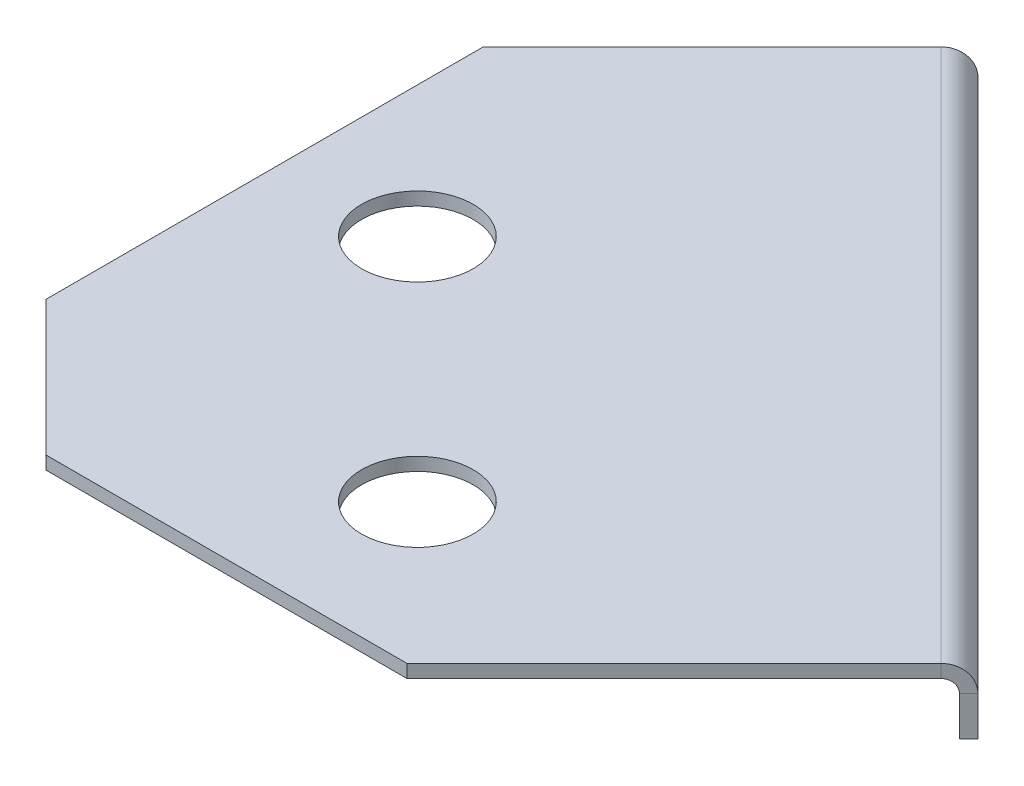
ISO-10303-21;
HEADER;
FILE_DESCRIPTION(('STEP AP214'),'2;1');
FILE_NAME('part.step','',(''),(''),'','','');
FILE_SCHEMA(('AUTOMOTIVE_DESIGN { 1 0 10303 214 1 1 1 1 }'));
ENDSEC;
DATA;
#1=APPLICATION_CONTEXT('core data for automotive mechanical design processes');
#2=APPLICATION_PROTOCOL_DEFINITION('international standard','automotive_design',2000,#1);
#3=PRODUCT_CONTEXT('',#1,'mechanical');
#4=PRODUCT('Part','Part','',(#3));
#5=PRODUCT_RELATED_PRODUCT_CATEGORY('part','',(#4));
#6=PRODUCT_DEFINITION_FORMATION('','',#4);
#7=PRODUCT_DEFINITION_CONTEXT('part definition',#1,'design');
#8=PRODUCT_DEFINITION('design','',#6,#7);
#9=PRODUCT_DEFINITION_SHAPE('','',#8);
#10=(LENGTH_UNIT() NAMED_UNIT(*) SI_UNIT(.MILLI.,.METRE.));
#11=(NAMED_UNIT(*) PLANE_ANGLE_UNIT() SI_UNIT($,.RADIAN.));
#12=(NAMED_UNIT(*) SI_UNIT($,.STERADIAN.) SOLID_ANGLE_UNIT());
#13=UNCERTAINTY_MEASURE_WITH_UNIT(LENGTH_MEASURE(1.E-05),#10,'distance_accuracy_value','');
#14=(GEOMETRIC_REPRESENTATION_CONTEXT(3) GLOBAL_UNCERTAINTY_ASSIGNED_CONTEXT((#13)) GLOBAL_UNIT_ASSIGNED_CONTEXT((#10,
#11,#12)) REPRESENTATION_CONTEXT('',''));
#15=CARTESIAN_POINT('',(0.,0.,0.));
#16=DIRECTION('',(0.,0.,1.));
#17=DIRECTION('',(1.,0.,0.));
#18=AXIS2_PLACEMENT_3D('',#15,#16,#17);
#19=CARTESIAN_POINT('',(-0.949979927557368,-0.2,7.02125460176061));
#20=DIRECTION('',(0.707106781186539,0.,0.707106781186556));
#21=DIRECTION('',(0.707106781186556,0.,-0.707106781186539));
#22=AXIS2_PLACEMENT_3D('',#19,#20,#21);
#23=PLANE('',#22);
#24=DIRECTION('',(0.707106781186556,0.,-0.707106781186539));
#25=VECTOR('',#24,1.);
#26=CARTESIAN_POINT('',(-0.949979927557368,-0.2,7.02125460176061));
#27=LINE('',#26,#25);
#28=CARTESIAN_POINT('',(-0.949979927557368,-0.2,7.02125460176061));
#29=VERTEX_POINT('',#28);
#30=CARTESIAN_POINT('',(3.11665363852389,-0.199999999999798,2.95462103567946));
#31=VERTEX_POINT('',#30);
#32=EDGE_CURVE('E198',#29,#31,#27,.T.);
#33=ORIENTED_EDGE('',*,*,#32,.T.);
#34=DIRECTION('',(-2.44595859093155E-13,1.,2.28116288110365E-13));
#35=VECTOR('',#34,1.);
#36=CARTESIAN_POINT('',(3.11665363852389,-0.199999999999798,2.95462103567946));
#37=LINE('',#36,#35);
#38=CARTESIAN_POINT('',(3.11665363852384,2.01661604082304E-13,2.9546210356795));
#39=VERTEX_POINT('',#38);
#40=EDGE_CURVE('E177',#31,#39,#37,.T.);
#41=ORIENTED_EDGE('',*,*,#40,.T.);
#42=DIRECTION('',(0.707106781186556,0.,-0.707106781186539));
#43=VECTOR('',#42,1.);
#44=CARTESIAN_POINT('',(-0.949979927557368,0.,7.02125460176061));
#45=LINE('',#44,#43);
#46=CARTESIAN_POINT('',(-0.949979927557368,0.,7.02125460176061));
#47=VERTEX_POINT('',#46);
#48=EDGE_CURVE('E190',#47,#39,#45,.T.);
#49=ORIENTED_EDGE('',*,*,#48,.F.);
#50=DIRECTION('',(0.,1.,0.));
#51=VECTOR('',#50,1.);
#52=CARTESIAN_POINT('',(-0.949979927557368,-0.2,7.02125460176061));
#53=LINE('',#52,#51);
#54=EDGE_CURVE('E11',#29,#47,#53,.T.);
#55=ORIENTED_EDGE('',*,*,#54,.F.);
#56=EDGE_LOOP('',(#33,#41,#49,#55));
#57=FACE_BOUND('',#56,.T.);
#58=ADVANCED_FACE('F40',(#57),#23,.T.);
#59=CARTESIAN_POINT('',(0.,-0.2,0.));
#60=DIRECTION('',(0.,1.,0.));
#61=DIRECTION('',(0.,0.,1.));
#62=AXIS2_PLACEMENT_3D('',#59,#60,#61);
#63=PLANE('',#62);
#64=CARTESIAN_POINT('',(-6.5,-0.2,1.31105583771245));
#65=DIRECTION('',(0.,1.,0.));
#66=DIRECTION('',(0.,0.,1.));
#67=AXIS2_PLACEMENT_3D('',#64,#65,#66);
#68=CIRCLE('',#67,0.849999999999994);
#69=CARTESIAN_POINT('',(-6.5,-0.2,2.16105583771244));
#70=VERTEX_POINT('',#69);
#71=EDGE_CURVE('E288',#70,#70,#68,.T.);
#72=ORIENTED_EDGE('',*,*,#71,.T.);
#73=EDGE_LOOP('',(#72));
#74=FACE_BOUND('',#73,.T.);
#75=CARTESIAN_POINT('',(-3.,-0.2,4.81105583771245));
#76=DIRECTION('',(0.,1.,0.));
#77=DIRECTION('',(0.,0.,1.));
#78=AXIS2_PLACEMENT_3D('',#75,#76,#77);
#79=CIRCLE('',#78,0.849999999999994);
#80=CARTESIAN_POINT('',(-3.,-0.2,5.66105583771244));
#81=VERTEX_POINT('',#80);
#82=EDGE_CURVE('E298',#81,#81,#79,.T.);
#83=ORIENTED_EDGE('',*,*,#82,.T.);
#84=EDGE_LOOP('',(#83));
#85=FACE_BOUND('',#84,.T.);
#86=DIRECTION('',(0.707106781186547,0.,0.707106781186547));
#87=VECTOR('',#86,1.);
#88=CARTESIAN_POINT('',(3.11665363852389,-0.199999999999798,2.95462103567946));
#89=LINE('',#88,#87);
#90=CARTESIAN_POINT('',(-5.01507434512098,-0.199999999999932,-5.17710694796541));
#91=VERTEX_POINT('',#90);
#92=EDGE_CURVE('E181',#31,#91,#89,.F.);
#93=ORIENTED_EDGE('',*,*,#92,.F.);
#94=ORIENTED_EDGE('',*,*,#32,.F.);
#95=DIRECTION('',(1.,0.,0.));
#96=VECTOR('',#95,1.);
#97=CARTESIAN_POINT('',(-6.44665548544419,-0.2,7.02125460176061));
#98=LINE('',#97,#96);
#99=CARTESIAN_POINT('',(-6.44665548544419,-0.2,7.02125460176061));
#100=VERTEX_POINT('',#99);
#101=EDGE_CURVE('E196',#100,#29,#98,.T.);
#102=ORIENTED_EDGE('',*,*,#101,.F.);
#103=DIRECTION('',(0.707106781186553,0.,0.707106781186542));
#104=VECTOR('',#103,1.);
#105=CARTESIAN_POINT('',(-8.50000000000009,-0.2,4.96791008720475));
#106=LINE('',#105,#104);
#107=CARTESIAN_POINT('',(-8.50000000000009,-0.2,4.96791008720475));
#108=VERTEX_POINT('',#107);
#109=EDGE_CURVE('E193',#108,#100,#106,.T.);
#110=ORIENTED_EDGE('',*,*,#109,.F.);
#111=DIRECTION('',(0.,0.,1.));
#112=VECTOR('',#111,1.);
#113=CARTESIAN_POINT('',(-8.5,-0.2,-1.69218129308647));
#114=LINE('',#113,#112);
#115=CARTESIAN_POINT('',(-8.5,-0.2,-1.69218129308647));
#116=VERTEX_POINT('',#115);
#117=EDGE_CURVE('E189',#116,#108,#114,.T.);
#118=ORIENTED_EDGE('',*,*,#117,.F.);
#119=DIRECTION('',(-0.707106781186556,0.,0.707106781186539));
#120=VECTOR('',#119,1.);
#121=CARTESIAN_POINT('',(-4.87365298888357,-0.2,-5.31852830420281));
#122=LINE('',#121,#120);
#123=EDGE_CURVE('E91',#91,#116,#122,.T.);
#124=ORIENTED_EDGE('',*,*,#123,.F.);
#125=EDGE_LOOP('',(#93,#94,#102,#110,#118,#124));
#126=FACE_BOUND('',#125,.T.);
#127=ADVANCED_FACE('F227',(#74,#85,#126),#63,.F.);
#128=CARTESIAN_POINT('',(0.,0.,0.));
#129=DIRECTION('',(0.,1.,0.));
#130=DIRECTION('',(0.,0.,1.));
#131=AXIS2_PLACEMENT_3D('',#128,#129,#130);
#132=PLANE('',#131);
#133=CARTESIAN_POINT('',(-6.5,0.,1.31105583771245));
#134=DIRECTION('',(0.,1.,0.));
#135=DIRECTION('',(0.,0.,1.));
#136=AXIS2_PLACEMENT_3D('',#133,#134,#135);
#137=CIRCLE('',#136,0.849999999999988);
#138=CARTESIAN_POINT('',(-6.5,0.,2.16105583771244));
#139=VERTEX_POINT('',#138);
#140=EDGE_CURVE('E291',#139,#139,#137,.T.);
#141=ORIENTED_EDGE('',*,*,#140,.F.);
#142=EDGE_LOOP('',(#141));
#143=FACE_BOUND('',#142,.T.);
#144=CARTESIAN_POINT('',(-3.,0.,4.81105583771245));
#145=DIRECTION('',(0.,1.,0.));
#146=DIRECTION('',(0.,0.,1.));
#147=AXIS2_PLACEMENT_3D('',#144,#145,#146);
#148=CIRCLE('',#147,0.849999999999988);
#149=CARTESIAN_POINT('',(-3.,0.,5.66105583771244));
#150=VERTEX_POINT('',#149);
#151=EDGE_CURVE('E293',#150,#150,#148,.T.);
#152=ORIENTED_EDGE('',*,*,#151,.F.);
#153=EDGE_LOOP('',(#152));
#154=FACE_BOUND('',#153,.T.);
#155=ORIENTED_EDGE('',*,*,#48,.T.);
#156=DIRECTION('',(0.707106781186547,0.,0.707106781186547));
#157=VECTOR('',#156,1.);
#158=CARTESIAN_POINT('',(3.11665363852384,2.01661604082304E-13,2.9546210356795));
#159=LINE('',#158,#157);
#160=CARTESIAN_POINT('',(-5.01507434512098,0.,-5.17710694796541));
#161=VERTEX_POINT('',#160);
#162=EDGE_CURVE('E131',#39,#161,#159,.F.);
#163=ORIENTED_EDGE('',*,*,#162,.T.);
#164=DIRECTION('',(-0.707106781186556,0.,0.707106781186539));
#165=VECTOR('',#164,1.);
#166=CARTESIAN_POINT('',(-4.87365298888357,0.,-5.31852830420281));
#167=LINE('',#166,#165);
#168=CARTESIAN_POINT('',(-8.5,0.,-1.69218129308647));
#169=VERTEX_POINT('',#168);
#170=EDGE_CURVE('E186',#161,#169,#167,.T.);
#171=ORIENTED_EDGE('',*,*,#170,.T.);
#172=DIRECTION('',(0.,0.,1.));
#173=VECTOR('',#172,1.);
#174=CARTESIAN_POINT('',(-8.5,0.,-1.69218129308647));
#175=LINE('',#174,#173);
#176=CARTESIAN_POINT('',(-8.50000000000009,0.,4.96791008720475));
#177=VERTEX_POINT('',#176);
#178=EDGE_CURVE('E201',#169,#177,#175,.T.);
#179=ORIENTED_EDGE('',*,*,#178,.T.);
#180=DIRECTION('',(0.707106781186553,0.,0.707106781186542));
#181=VECTOR('',#180,1.);
#182=CARTESIAN_POINT('',(-8.50000000000009,0.,4.96791008720475));
#183=LINE('',#182,#181);
#184=CARTESIAN_POINT('',(-6.44665548544419,0.,7.02125460176061));
#185=VERTEX_POINT('',#184);
#186=EDGE_CURVE('E204',#177,#185,#183,.T.);
#187=ORIENTED_EDGE('',*,*,#186,.T.);
#188=DIRECTION('',(1.,0.,0.));
#189=VECTOR('',#188,1.);
#190=CARTESIAN_POINT('',(-6.44665548544419,0.,7.02125460176061));
#191=LINE('',#190,#189);
#192=EDGE_CURVE('E207',#185,#47,#191,.T.);
#193=ORIENTED_EDGE('',*,*,#192,.T.);
#194=EDGE_LOOP('',(#155,#163,#171,#179,#187,#193));
#195=FACE_BOUND('',#194,.T.);
#196=ADVANCED_FACE('F219',(#143,#154,#195),#132,.T.);
#197=CARTESIAN_POINT('',(-6.44665548544419,-0.2,7.02125460176061));
#198=DIRECTION('',(0.,0.,1.));
#199=DIRECTION('',(1.,0.,0.));
#200=AXIS2_PLACEMENT_3D('',#197,#198,#199);
#201=PLANE('',#200);
#202=ORIENTED_EDGE('',*,*,#192,.F.);
#203=DIRECTION('',(0.,1.,0.));
#204=VECTOR('',#203,1.);
#205=CARTESIAN_POINT('',(-6.44665548544419,-0.2,7.02125460176061));
#206=LINE('',#205,#204);
#207=EDGE_CURVE('E49',#100,#185,#206,.T.);
#208=ORIENTED_EDGE('',*,*,#207,.F.);
#209=ORIENTED_EDGE('',*,*,#101,.T.);
#210=ORIENTED_EDGE('',*,*,#54,.T.);
#211=EDGE_LOOP('',(#202,#208,#209,#210));
#212=FACE_BOUND('',#211,.T.);
#213=ADVANCED_FACE('F232',(#212),#201,.T.);
#214=CARTESIAN_POINT('',(-8.50000000000009,-0.2,4.96791008720475));
#215=DIRECTION('',(-0.707106781186542,0.,0.707106781186553));
#216=DIRECTION('',(0.707106781186553,0.,0.707106781186542));
#217=AXIS2_PLACEMENT_3D('',#214,#215,#216);
#218=PLANE('',#217);
#219=ORIENTED_EDGE('',*,*,#186,.F.);
#220=DIRECTION('',(0.,1.,0.));
#221=VECTOR('',#220,1.);
#222=CARTESIAN_POINT('',(-8.50000000000009,-0.2,4.96791008720475));
#223=LINE('',#222,#221);
#224=EDGE_CURVE('E211',#108,#177,#223,.T.);
#225=ORIENTED_EDGE('',*,*,#224,.F.);
#226=ORIENTED_EDGE('',*,*,#109,.T.);
#227=ORIENTED_EDGE('',*,*,#207,.T.);
#228=EDGE_LOOP('',(#219,#225,#226,#227));
#229=FACE_BOUND('',#228,.T.);
#230=ADVANCED_FACE('F231',(#229),#218,.T.);
#231=CARTESIAN_POINT('',(-8.5,-0.2,-1.69218129308647));
#232=DIRECTION('',(-1.,0.,0.));
#233=DIRECTION('',(0.,0.,1.));
#234=AXIS2_PLACEMENT_3D('',#231,#232,#233);
#235=PLANE('',#234);
#236=ORIENTED_EDGE('',*,*,#178,.F.);
#237=DIRECTION('',(0.,1.,0.));
#238=VECTOR('',#237,1.);
#239=CARTESIAN_POINT('',(-8.5,-0.2,-1.69218129308647));
#240=LINE('',#239,#238);
#241=EDGE_CURVE('E44',#116,#169,#240,.T.);
#242=ORIENTED_EDGE('',*,*,#241,.F.);
#243=ORIENTED_EDGE('',*,*,#117,.T.);
#244=ORIENTED_EDGE('',*,*,#224,.T.);
#245=EDGE_LOOP('',(#236,#242,#243,#244));
#246=FACE_BOUND('',#245,.T.);
#247=ADVANCED_FACE('F217',(#246),#235,.T.);
#248=CARTESIAN_POINT('',(-4.87365298888357,-0.2,-5.31852830420281));
#249=DIRECTION('',(-0.707106781186539,0.,-0.707106781186556));
#250=DIRECTION('',(-0.707106781186556,0.,0.707106781186539));
#251=AXIS2_PLACEMENT_3D('',#248,#249,#250);
#252=PLANE('',#251);
#253=DIRECTION('',(-2.51534904016552E-13,1.,2.16840434497027E-13));
#254=VECTOR('',#253,1.);
#255=CARTESIAN_POINT('',(-5.01507434512098,-0.199999999999932,-5.17710694796541));
#256=LINE('',#255,#254);
#257=EDGE_CURVE('E184',#91,#161,#256,.T.);
#258=ORIENTED_EDGE('',*,*,#257,.F.);
#259=ORIENTED_EDGE('',*,*,#123,.T.);
#260=ORIENTED_EDGE('',*,*,#241,.T.);
#261=ORIENTED_EDGE('',*,*,#170,.F.);
#262=EDGE_LOOP('',(#258,#259,#260,#261));
#263=FACE_BOUND('',#262,.T.);
#264=ADVANCED_FACE('F42',(#263),#252,.T.);
#265=CARTESIAN_POINT('',(-5.01507434512093,-0.4,-5.17710694796545));
#266=DIRECTION('',(-0.707106781186547,0.,-0.707106781186547));
#267=DIRECTION('',(-0.707106781186548,0.,0.707106781186548));
#268=AXIS2_PLACEMENT_3D('',#265,#266,#267);
#269=PLANE('',#268);
#270=DIRECTION('',(0.707106781186556,0.,-0.707106781186539));
#271=VECTOR('',#270,1.);
#272=CARTESIAN_POINT('',(-4.87365298888357,-0.399999999999999,-5.31852830420281));
#273=LINE('',#272,#271);
#274=CARTESIAN_POINT('',(-4.87365298888357,-0.399999999999999,-5.31852830420281));
#275=VERTEX_POINT('',#274);
#276=CARTESIAN_POINT('',(-4.73223163264626,-0.399999999999998,-5.45994966044012));
#277=VERTEX_POINT('',#276);
#278=EDGE_CURVE('E301',#275,#277,#273,.T.);
#279=ORIENTED_EDGE('',*,*,#278,.F.);
#280=CARTESIAN_POINT('',(-5.01507434512093,-0.4,-5.17710694796545));
#281=DIRECTION('',(0.707106781186547,0.,0.707106781186547));
#282=DIRECTION('',(0.707106781186548,0.,-0.707106781186548));
#283=AXIS2_PLACEMENT_3D('',#280,#281,#282);
#284=CIRCLE('',#283,0.200000000000068);
#285=EDGE_CURVE('E134',#91,#275,#284,.F.);
#286=ORIENTED_EDGE('',*,*,#285,.F.);
#287=ORIENTED_EDGE('',*,*,#257,.T.);
#288=CARTESIAN_POINT('',(-5.01507434512093,-0.4,-5.17710694796545));
#289=DIRECTION('',(0.707106781186547,0.,0.707106781186547));
#290=DIRECTION('',(0.707106781186548,0.,-0.707106781186548));
#291=AXIS2_PLACEMENT_3D('',#288,#289,#290);
#292=CIRCLE('',#291,0.400000000000068);
#293=EDGE_CURVE('E57',#161,#277,#292,.F.);
#294=ORIENTED_EDGE('',*,*,#293,.T.);
#295=EDGE_LOOP('',(#279,#286,#287,#294));
#296=FACE_BOUND('',#295,.T.);
#297=ADVANCED_FACE('F252',(#296),#269,.T.);
#298=CARTESIAN_POINT('',(3.11665363852393,-0.399999999999866,2.95462103567941));
#299=DIRECTION('',(-0.707106781186547,0.,-0.707106781186547));
#300=DIRECTION('',(-0.707106781186548,0.,0.707106781186548));
#301=AXIS2_PLACEMENT_3D('',#298,#299,#300);
#302=PLANE('',#301);
#303=CARTESIAN_POINT('',(3.11665363852393,-0.399999999999866,2.95462103567941));
#304=DIRECTION('',(0.707106781186547,0.,0.707106781186547));
#305=DIRECTION('',(0.707106781186548,0.,-0.707106781186548));
#306=AXIS2_PLACEMENT_3D('',#303,#304,#305);
#307=CIRCLE('',#306,0.200000000000068);
#308=CARTESIAN_POINT('',(3.25807499476129,-0.399999999999865,2.81319967944205));
#309=VERTEX_POINT('',#308);
#310=EDGE_CURVE('E141',#309,#31,#307,.T.);
#311=ORIENTED_EDGE('',*,*,#310,.F.);
#312=DIRECTION('',(0.707106781186556,0.,-0.707106781186539));
#313=VECTOR('',#312,1.);
#314=CARTESIAN_POINT('',(3.2580749947612,-0.399999999999865,2.81319967944215));
#315=LINE('',#314,#313);
#316=CARTESIAN_POINT('',(3.39949635099851,-0.399999999999864,2.67177832320484));
#317=VERTEX_POINT('',#316);
#318=EDGE_CURVE('E138',#309,#317,#315,.T.);
#319=ORIENTED_EDGE('',*,*,#318,.T.);
#320=CARTESIAN_POINT('',(3.11665363852393,-0.399999999999866,2.95462103567941));
#321=DIRECTION('',(0.707106781186547,0.,0.707106781186547));
#322=DIRECTION('',(0.707106781186548,0.,-0.707106781186548));
#323=AXIS2_PLACEMENT_3D('',#320,#321,#322);
#324=CIRCLE('',#323,0.400000000000068);
#325=EDGE_CURVE('E125',#317,#39,#324,.T.);
#326=ORIENTED_EDGE('',*,*,#325,.T.);
#327=ORIENTED_EDGE('',*,*,#40,.F.);
#328=EDGE_LOOP('',(#311,#319,#326,#327));
#329=FACE_BOUND('',#328,.T.);
#330=ADVANCED_FACE('F139',(#329),#302,.F.);
#331=CARTESIAN_POINT('',(3.11665363852393,-0.399999999999866,2.95462103567941));
#332=DIRECTION('',(0.707106781186547,0.,0.707106781186547));
#333=DIRECTION('',(0.707106781186548,0.,-0.707106781186548));
#334=AXIS2_PLACEMENT_3D('',#331,#332,#333);
#335=CYLINDRICAL_SURFACE('',#334,0.400000000000068);
#336=ORIENTED_EDGE('',*,*,#162,.F.);
#337=ORIENTED_EDGE('',*,*,#325,.F.);
#338=DIRECTION('',(-0.707106781186539,0.,-0.707106781186556));
#339=VECTOR('',#338,1.);
#340=CARTESIAN_POINT('',(0.363859013896878,-0.399999999999914,-0.363859013896863));
#341=LINE('',#340,#339);
#342=EDGE_CURVE('E129',#317,#277,#341,.T.);
#343=ORIENTED_EDGE('',*,*,#342,.T.);
#344=ORIENTED_EDGE('',*,*,#293,.F.);
#345=EDGE_LOOP('',(#336,#337,#343,#344));
#346=FACE_BOUND('',#345,.T.);
#347=ADVANCED_FACE('F127',(#346),#335,.T.);
#348=CARTESIAN_POINT('',(3.11665363852393,-0.399999999999866,2.95462103567941));
#349=DIRECTION('',(0.707106781186547,0.,0.707106781186547));
#350=DIRECTION('',(0.707106781186548,0.,-0.707106781186548));
#351=AXIS2_PLACEMENT_3D('',#348,#349,#350);
#352=CYLINDRICAL_SURFACE('',#351,0.200000000000068);
#353=ORIENTED_EDGE('',*,*,#92,.T.);
#354=ORIENTED_EDGE('',*,*,#285,.T.);
#355=DIRECTION('',(0.707106781186539,0.,0.707106781186556));
#356=VECTOR('',#355,1.);
#357=CARTESIAN_POINT('',(-4.87365298888357,-0.399999999999999,-5.31852830420281));
#358=LINE('',#357,#356);
#359=EDGE_CURVE('E145',#275,#309,#358,.T.);
#360=ORIENTED_EDGE('',*,*,#359,.T.);
#361=ORIENTED_EDGE('',*,*,#310,.T.);
#362=EDGE_LOOP('',(#353,#354,#360,#361));
#363=FACE_BOUND('',#362,.T.);
#364=ADVANCED_FACE('F223',(#363),#352,.F.);
#365=CARTESIAN_POINT('',(3.39949635099851,-1.,2.67177832320484));
#366=DIRECTION('',(-0.707106781186539,0.,-0.707106781186556));
#367=DIRECTION('',(-0.707106781186556,0.,0.707106781186539));
#368=AXIS2_PLACEMENT_3D('',#365,#366,#367);
#369=PLANE('',#368);
#370=ORIENTED_EDGE('',*,*,#318,.F.);
#371=DIRECTION('',(0.,-1.,0.));
#372=VECTOR('',#371,1.);
#373=CARTESIAN_POINT('',(3.2580749947612,-1.,2.81319967944214));
#374=LINE('',#373,#372);
#375=CARTESIAN_POINT('',(3.2580749947612,-1.,2.81319967944214));
#376=VERTEX_POINT('',#375);
#377=EDGE_CURVE('E154',#309,#376,#374,.T.);
#378=ORIENTED_EDGE('',*,*,#377,.T.);
#379=DIRECTION('',(-0.707106781186556,0.,0.707106781186539));
#380=VECTOR('',#379,1.);
#381=CARTESIAN_POINT('',(3.39949635099851,-1.,2.67177832320484));
#382=LINE('',#381,#380);
#383=CARTESIAN_POINT('',(3.39949635099851,-1.,2.67177832320484));
#384=VERTEX_POINT('',#383);
#385=EDGE_CURVE('E159',#384,#376,#382,.T.);
#386=ORIENTED_EDGE('',*,*,#385,.F.);
#387=DIRECTION('',(0.,-1.,0.));
#388=VECTOR('',#387,1.);
#389=CARTESIAN_POINT('',(3.39949635099851,-1.,2.67177832320484));
#390=LINE('',#389,#388);
#391=EDGE_CURVE('E150',#317,#384,#390,.T.);
#392=ORIENTED_EDGE('',*,*,#391,.F.);
#393=EDGE_LOOP('',(#370,#378,#386,#392));
#394=FACE_BOUND('',#393,.T.);
#395=ADVANCED_FACE('F157',(#394),#369,.F.);
#396=CARTESIAN_POINT('',(-4.73223163264626,-0.199999999999999,-5.45994966044012));
#397=DIRECTION('',(0.707106781186539,0.,0.707106781186556));
#398=DIRECTION('',(0.707106781186556,0.,-0.707106781186539));
#399=AXIS2_PLACEMENT_3D('',#396,#397,#398);
#400=PLANE('',#399);
#401=ORIENTED_EDGE('',*,*,#278,.T.);
#402=DIRECTION('',(0.,1.,0.));
#403=VECTOR('',#402,1.);
#404=CARTESIAN_POINT('',(-4.73223163264626,-0.199999999999999,-5.45994966044012));
#405=LINE('',#404,#403);
#406=CARTESIAN_POINT('',(-4.73223163264626,-1.,-5.45994966044012));
#407=VERTEX_POINT('',#406);
#408=EDGE_CURVE('E153',#407,#277,#405,.T.);
#409=ORIENTED_EDGE('',*,*,#408,.F.);
#410=DIRECTION('',(-0.707106781186556,0.,0.707106781186539));
#411=VECTOR('',#410,1.);
#412=CARTESIAN_POINT('',(-4.73223163264626,-1.,-5.45994966044012));
#413=LINE('',#412,#411);
#414=CARTESIAN_POINT('',(-4.87365298888357,-1.,-5.31852830420281));
#415=VERTEX_POINT('',#414);
#416=EDGE_CURVE('E170',#407,#415,#413,.T.);
#417=ORIENTED_EDGE('',*,*,#416,.T.);
#418=DIRECTION('',(0.,1.,0.));
#419=VECTOR('',#418,1.);
#420=CARTESIAN_POINT('',(-4.87365298888357,-0.2,-5.31852830420281));
#421=LINE('',#420,#419);
#422=EDGE_CURVE('E161',#415,#275,#421,.T.);
#423=ORIENTED_EDGE('',*,*,#422,.T.);
#424=EDGE_LOOP('',(#401,#409,#417,#423));
#425=FACE_BOUND('',#424,.T.);
#426=ADVANCED_FACE('F262',(#425),#400,.F.);
#427=CARTESIAN_POINT('',(0.363859013896873,0.,-0.363859013896865));
#428=DIRECTION('',(-0.707106781186556,0.,0.707106781186539));
#429=DIRECTION('',(0.707106781186539,0.,0.707106781186556));
#430=AXIS2_PLACEMENT_3D('',#427,#428,#429);
#431=PLANE('',#430);
#432=ORIENTED_EDGE('',*,*,#342,.F.);
#433=ORIENTED_EDGE('',*,*,#391,.T.);
#434=DIRECTION('',(-0.707106781186539,0.,-0.707106781186556));
#435=VECTOR('',#434,1.);
#436=CARTESIAN_POINT('',(-4.73223163264626,-1.,-5.45994966044012));
#437=LINE('',#436,#435);
#438=EDGE_CURVE('E160',#384,#407,#437,.T.);
#439=ORIENTED_EDGE('',*,*,#438,.T.);
#440=ORIENTED_EDGE('',*,*,#408,.T.);
#441=EDGE_LOOP('',(#432,#433,#439,#440));
#442=FACE_BOUND('',#441,.T.);
#443=ADVANCED_FACE('F149',(#442),#431,.F.);
#444=CARTESIAN_POINT('',(0.222437657659562,0.,-0.222437657659557));
#445=DIRECTION('',(-0.707106781186556,0.,0.707106781186539));
#446=DIRECTION('',(0.707106781186539,0.,0.707106781186556));
#447=AXIS2_PLACEMENT_3D('',#444,#445,#446);
#448=PLANE('',#447);
#449=ORIENTED_EDGE('',*,*,#377,.F.);
#450=ORIENTED_EDGE('',*,*,#359,.F.);
#451=ORIENTED_EDGE('',*,*,#422,.F.);
#452=DIRECTION('',(-0.707106781186539,0.,-0.707106781186556));
#453=VECTOR('',#452,1.);
#454=CARTESIAN_POINT('',(-4.87365298888357,-1.,-5.31852830420281));
#455=LINE('',#454,#453);
#456=EDGE_CURVE('E165',#376,#415,#455,.T.);
#457=ORIENTED_EDGE('',*,*,#456,.F.);
#458=EDGE_LOOP('',(#449,#450,#451,#457));
#459=FACE_BOUND('',#458,.T.);
#460=ADVANCED_FACE('F267',(#459),#448,.T.);
#461=CARTESIAN_POINT('',(-4.73223163264626,-1.,-5.45994966044012));
#462=DIRECTION('',(0.,1.,0.));
#463=DIRECTION('',(-1.,0.,0.));
#464=AXIS2_PLACEMENT_3D('',#461,#462,#463);
#465=PLANE('',#464);
#466=ORIENTED_EDGE('',*,*,#456,.T.);
#467=ORIENTED_EDGE('',*,*,#416,.F.);
#468=ORIENTED_EDGE('',*,*,#438,.F.);
#469=ORIENTED_EDGE('',*,*,#385,.T.);
#470=EDGE_LOOP('',(#466,#467,#468,#469));
#471=FACE_BOUND('',#470,.T.);
#472=ADVANCED_FACE('F263',(#471),#465,.F.);
#473=CARTESIAN_POINT('',(-3.,0.,4.81105583771245));
#474=DIRECTION('',(0.,1.,0.));
#475=DIRECTION('',(0.,0.,1.));
#476=AXIS2_PLACEMENT_3D('',#473,#474,#475);
#477=CYLINDRICAL_SURFACE('',#476,0.849999999999994);
#478=ORIENTED_EDGE('',*,*,#82,.F.);
#479=EDGE_LOOP('',(#478));
#480=FACE_BOUND('',#479,.T.);
#481=ORIENTED_EDGE('',*,*,#151,.T.);
#482=EDGE_LOOP('',(#481));
#483=FACE_BOUND('',#482,.T.);
#484=ADVANCED_FACE('F266',(#480,#483),#477,.F.);
#485=CARTESIAN_POINT('',(-6.5,0.,1.31105583771245));
#486=DIRECTION('',(0.,1.,0.));
#487=DIRECTION('',(0.,0.,1.));
#488=AXIS2_PLACEMENT_3D('',#485,#486,#487);
#489=CYLINDRICAL_SURFACE('',#488,0.849999999999994);
#490=ORIENTED_EDGE('',*,*,#71,.F.);
#491=EDGE_LOOP('',(#490));
#492=FACE_BOUND('',#491,.T.);
#493=ORIENTED_EDGE('',*,*,#140,.T.);
#494=EDGE_LOOP('',(#493));
#495=FACE_BOUND('',#494,.T.);
#496=ADVANCED_FACE('F279',(#492,#495),#489,.F.);
#497=CLOSED_SHELL('',(#58,#127,#196,#213,#230,#247,#264,#297,#330,#347,#364,#395,#426,#443,#460,
#472,#484,#496));
#498=MANIFOLD_SOLID_BREP('B2',#497);
#499=ADVANCED_BREP_SHAPE_REPRESENTATION('',(#18,#498),#14);
#500=SHAPE_DEFINITION_REPRESENTATION(#9,#499);
ENDSEC;
END-ISO-10303-21;
